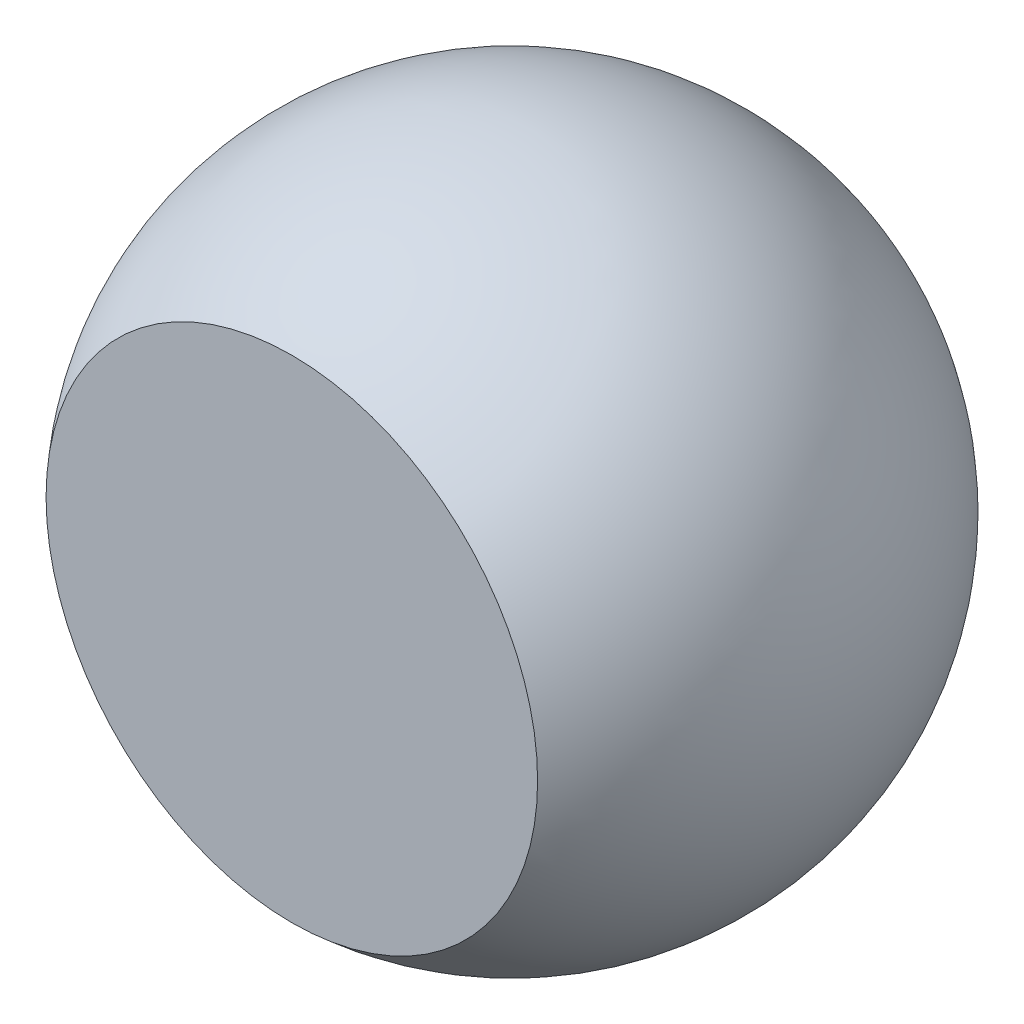
ISO-10303-21;
HEADER;
FILE_DESCRIPTION(('STEP AP214'),'2;1');
FILE_NAME('part.step','',(''),(''),'','','');
FILE_SCHEMA(('AUTOMOTIVE_DESIGN { 1 0 10303 214 1 1 1 1 }'));
ENDSEC;
DATA;
#1=APPLICATION_CONTEXT('core data for automotive mechanical design processes');
#2=APPLICATION_PROTOCOL_DEFINITION('international standard','automotive_design',2000,#1);
#3=PRODUCT_CONTEXT('',#1,'mechanical');
#4=PRODUCT('Part','Part','',(#3));
#5=PRODUCT_RELATED_PRODUCT_CATEGORY('part','',(#4));
#6=PRODUCT_DEFINITION_FORMATION('','',#4);
#7=PRODUCT_DEFINITION_CONTEXT('part definition',#1,'design');
#8=PRODUCT_DEFINITION('design','',#6,#7);
#9=PRODUCT_DEFINITION_SHAPE('','',#8);
#10=(LENGTH_UNIT() NAMED_UNIT(*) SI_UNIT(.MILLI.,.METRE.));
#11=(NAMED_UNIT(*) PLANE_ANGLE_UNIT() SI_UNIT($,.RADIAN.));
#12=(NAMED_UNIT(*) SI_UNIT($,.STERADIAN.) SOLID_ANGLE_UNIT());
#13=UNCERTAINTY_MEASURE_WITH_UNIT(LENGTH_MEASURE(1.E-05),#10,'distance_accuracy_value','');
#14=(GEOMETRIC_REPRESENTATION_CONTEXT(3) GLOBAL_UNCERTAINTY_ASSIGNED_CONTEXT((#13)) GLOBAL_UNIT_ASSIGNED_CONTEXT((#10,
#11,#12)) REPRESENTATION_CONTEXT('',''));
#15=CARTESIAN_POINT('',(0.,0.,0.));
#16=DIRECTION('',(0.,0.,1.));
#17=DIRECTION('',(1.,0.,0.));
#18=AXIS2_PLACEMENT_3D('',#15,#16,#17);
#19=CARTESIAN_POINT('',(0.,0.,0.));
#20=DIRECTION('',(0.,0.,-1.));
#21=DIRECTION('',(1.,0.,0.));
#22=AXIS2_PLACEMENT_3D('',#19,#20,#21);
#23=SPHERICAL_SURFACE('',#22,0.3);
#24=CARTESIAN_POINT('',(0.,0.,0.2));
#25=DIRECTION('',(0.,0.,-1.));
#26=DIRECTION('',(-1.,0.,0.));
#27=AXIS2_PLACEMENT_3D('',#24,#25,#26);
#28=CIRCLE('',#27,0.223606797749979);
#29=CARTESIAN_POINT('',(-0.223606797749979,0.,0.2));
#30=VERTEX_POINT('',#29);
#31=EDGE_CURVE('E10',#30,#30,#28,.T.);
#32=ORIENTED_EDGE('',*,*,#31,.T.);
#33=EDGE_LOOP('',(#32));
#34=FACE_BOUND('',#33,.T.);
#35=ADVANCED_FACE('F33',(#34),#23,.T.);
#36=CARTESIAN_POINT('',(0.,0.,0.2));
#37=DIRECTION('',(0.,0.,-1.));
#38=DIRECTION('',(-1.,0.,0.));
#39=AXIS2_PLACEMENT_3D('',#36,#37,#38);
#40=PLANE('',#39);
#41=ORIENTED_EDGE('',*,*,#31,.F.);
#42=EDGE_LOOP('',(#41));
#43=FACE_BOUND('',#42,.T.);
#44=ADVANCED_FACE('F41',(#43),#40,.F.);
#45=CLOSED_SHELL('',(#35,#44));
#46=MANIFOLD_SOLID_BREP('B2',#45);
#47=ADVANCED_BREP_SHAPE_REPRESENTATION('',(#18,#46),#14);
#48=SHAPE_DEFINITION_REPRESENTATION(#9,#47);
ENDSEC;
END-ISO-10303-21;
